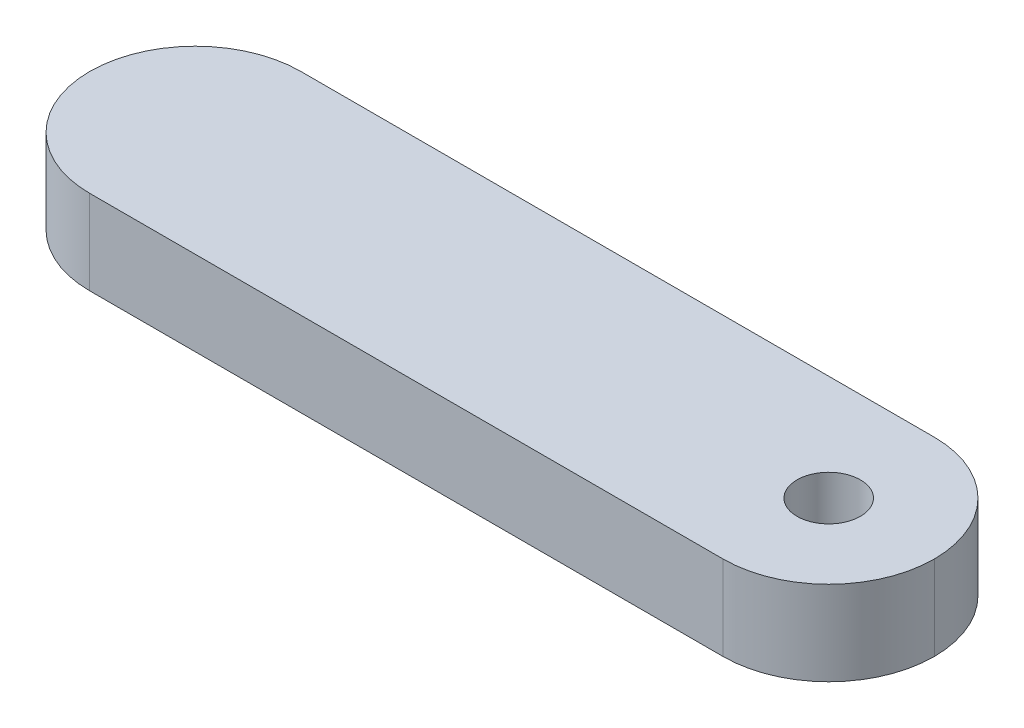
ISO-10303-21;
HEADER;
FILE_DESCRIPTION(('STEP AP214'),'2;1');
FILE_NAME('part.step','',(''),(''),'','','');
FILE_SCHEMA(('AUTOMOTIVE_DESIGN { 1 0 10303 214 1 1 1 1 }'));
ENDSEC;
DATA;
#1=APPLICATION_CONTEXT('core data for automotive mechanical design processes');
#2=APPLICATION_PROTOCOL_DEFINITION('international standard','automotive_design',2000,#1);
#3=PRODUCT_CONTEXT('',#1,'mechanical');
#4=PRODUCT('Part','Part','',(#3));
#5=PRODUCT_RELATED_PRODUCT_CATEGORY('part','',(#4));
#6=PRODUCT_DEFINITION_FORMATION('','',#4);
#7=PRODUCT_DEFINITION_CONTEXT('part definition',#1,'design');
#8=PRODUCT_DEFINITION('design','',#6,#7);
#9=PRODUCT_DEFINITION_SHAPE('','',#8);
#10=(LENGTH_UNIT() NAMED_UNIT(*) SI_UNIT(.MILLI.,.METRE.));
#11=(NAMED_UNIT(*) PLANE_ANGLE_UNIT() SI_UNIT($,.RADIAN.));
#12=(NAMED_UNIT(*) SI_UNIT($,.STERADIAN.) SOLID_ANGLE_UNIT());
#13=UNCERTAINTY_MEASURE_WITH_UNIT(LENGTH_MEASURE(1.E-05),#10,'distance_accuracy_value','');
#14=(GEOMETRIC_REPRESENTATION_CONTEXT(3) GLOBAL_UNCERTAINTY_ASSIGNED_CONTEXT((#13)) GLOBAL_UNIT_ASSIGNED_CONTEXT((#10,
#11,#12)) REPRESENTATION_CONTEXT('',''));
#15=CARTESIAN_POINT('',(0.,0.,0.));
#16=DIRECTION('',(0.,0.,1.));
#17=DIRECTION('',(1.,0.,0.));
#18=AXIS2_PLACEMENT_3D('',#15,#16,#17);
#19=CARTESIAN_POINT('',(-200.,40.,-50.));
#20=DIRECTION('',(0.,0.,1.));
#21=DIRECTION('',(1.,0.,0.));
#22=AXIS2_PLACEMENT_3D('',#19,#20,#21);
#23=PLANE('',#22);
#24=DIRECTION('',(-1.,0.,0.));
#25=VECTOR('',#24,1.);
#26=CARTESIAN_POINT('',(-200.,0.,-50.));
#27=LINE('',#26,#25);
#28=CARTESIAN_POINT('',(150.,0.,-50.));
#29=VERTEX_POINT('',#28);
#30=CARTESIAN_POINT('',(-150.,0.,-50.));
#31=VERTEX_POINT('',#30);
#32=EDGE_CURVE('E105',#29,#31,#27,.T.);
#33=ORIENTED_EDGE('',*,*,#32,.T.);
#34=DIRECTION('',(0.,-1.,0.));
#35=VECTOR('',#34,1.);
#36=CARTESIAN_POINT('',(-150.,40.,-50.));
#37=LINE('',#36,#35);
#38=CARTESIAN_POINT('',(-150.,40.,-50.));
#39=VERTEX_POINT('',#38);
#40=EDGE_CURVE('E160',#31,#39,#37,.F.);
#41=ORIENTED_EDGE('',*,*,#40,.T.);
#42=DIRECTION('',(-1.,0.,0.));
#43=VECTOR('',#42,1.);
#44=CARTESIAN_POINT('',(-200.,40.,-50.));
#45=LINE('',#44,#43);
#46=CARTESIAN_POINT('',(150.,40.,-50.));
#47=VERTEX_POINT('',#46);
#48=EDGE_CURVE('E141',#47,#39,#45,.T.);
#49=ORIENTED_EDGE('',*,*,#48,.F.);
#50=DIRECTION('',(0.,-1.,0.));
#51=VECTOR('',#50,1.);
#52=CARTESIAN_POINT('',(150.,40.,-50.));
#53=LINE('',#52,#51);
#54=EDGE_CURVE('E157',#47,#29,#53,.T.);
#55=ORIENTED_EDGE('',*,*,#54,.T.);
#56=EDGE_LOOP('',(#33,#41,#49,#55));
#57=FACE_BOUND('',#56,.T.);
#58=ADVANCED_FACE('F45',(#57),#23,.F.);
#59=CARTESIAN_POINT('',(-200.,40.,50.));
#60=DIRECTION('',(0.,0.,-1.));
#61=DIRECTION('',(-1.,0.,0.));
#62=AXIS2_PLACEMENT_3D('',#59,#60,#61);
#63=PLANE('',#62);
#64=DIRECTION('',(1.,0.,0.));
#65=VECTOR('',#64,1.);
#66=CARTESIAN_POINT('',(-200.,40.,50.));
#67=LINE('',#66,#65);
#68=CARTESIAN_POINT('',(-150.,40.,50.));
#69=VERTEX_POINT('',#68);
#70=CARTESIAN_POINT('',(150.,40.,50.));
#71=VERTEX_POINT('',#70);
#72=EDGE_CURVE('E118',#69,#71,#67,.T.);
#73=ORIENTED_EDGE('',*,*,#72,.F.);
#74=DIRECTION('',(0.,-1.,0.));
#75=VECTOR('',#74,1.);
#76=CARTESIAN_POINT('',(-150.,40.,50.));
#77=LINE('',#76,#75);
#78=CARTESIAN_POINT('',(-150.,0.,50.));
#79=VERTEX_POINT('',#78);
#80=EDGE_CURVE('E11',#69,#79,#77,.T.);
#81=ORIENTED_EDGE('',*,*,#80,.T.);
#82=DIRECTION('',(1.,0.,0.));
#83=VECTOR('',#82,1.);
#84=CARTESIAN_POINT('',(-200.,0.,50.));
#85=LINE('',#84,#83);
#86=CARTESIAN_POINT('',(150.,0.,50.));
#87=VERTEX_POINT('',#86);
#88=EDGE_CURVE('E145',#79,#87,#85,.T.);
#89=ORIENTED_EDGE('',*,*,#88,.T.);
#90=DIRECTION('',(0.,-1.,0.));
#91=VECTOR('',#90,1.);
#92=CARTESIAN_POINT('',(150.,40.,50.));
#93=LINE('',#92,#91);
#94=EDGE_CURVE('E55',#87,#71,#93,.F.);
#95=ORIENTED_EDGE('',*,*,#94,.T.);
#96=EDGE_LOOP('',(#73,#81,#89,#95));
#97=FACE_BOUND('',#96,.T.);
#98=ADVANCED_FACE('F188',(#97),#63,.F.);
#99=CARTESIAN_POINT('',(0.,40.,0.));
#100=DIRECTION('',(0.,-1.,0.));
#101=DIRECTION('',(0.,0.,-1.));
#102=AXIS2_PLACEMENT_3D('',#99,#100,#101);
#103=PLANE('',#102);
#104=CARTESIAN_POINT('',(150.,40.,0.));
#105=DIRECTION('',(0.,1.,0.));
#106=DIRECTION('',(0.,0.,1.));
#107=AXIS2_PLACEMENT_3D('',#104,#105,#106);
#108=CIRCLE('',#107,15.);
#109=CARTESIAN_POINT('',(150.,40.,15.));
#110=VERTEX_POINT('',#109);
#111=EDGE_CURVE('E138',#110,#110,#108,.T.);
#112=ORIENTED_EDGE('',*,*,#111,.F.);
#113=EDGE_LOOP('',(#112));
#114=FACE_BOUND('',#113,.T.);
#115=ORIENTED_EDGE('',*,*,#48,.T.);
#116=CARTESIAN_POINT('',(-150.,40.,0.));
#117=DIRECTION('',(0.,-1.,0.));
#118=DIRECTION('',(0.,0.,-1.));
#119=AXIS2_PLACEMENT_3D('',#116,#117,#118);
#120=CIRCLE('',#119,50.);
#121=CARTESIAN_POINT('',(-200.,40.,0.));
#122=VERTEX_POINT('',#121);
#123=EDGE_CURVE('E171',#39,#122,#120,.F.);
#124=ORIENTED_EDGE('',*,*,#123,.T.);
#125=CARTESIAN_POINT('',(-150.,40.,0.));
#126=DIRECTION('',(0.,-1.,0.));
#127=DIRECTION('',(0.,0.,-1.));
#128=AXIS2_PLACEMENT_3D('',#125,#126,#127);
#129=CIRCLE('',#128,50.);
#130=EDGE_CURVE('E69',#122,#69,#129,.F.);
#131=ORIENTED_EDGE('',*,*,#130,.T.);
#132=ORIENTED_EDGE('',*,*,#72,.T.);
#133=CARTESIAN_POINT('',(150.,40.,0.));
#134=DIRECTION('',(0.,-1.,0.));
#135=DIRECTION('',(0.,0.,-1.));
#136=AXIS2_PLACEMENT_3D('',#133,#134,#135);
#137=CIRCLE('',#136,50.);
#138=CARTESIAN_POINT('',(200.,40.,0.));
#139=VERTEX_POINT('',#138);
#140=EDGE_CURVE('E164',#71,#139,#137,.F.);
#141=ORIENTED_EDGE('',*,*,#140,.T.);
#142=CARTESIAN_POINT('',(150.,40.,0.));
#143=DIRECTION('',(0.,-1.,0.));
#144=DIRECTION('',(0.,0.,-1.));
#145=AXIS2_PLACEMENT_3D('',#142,#143,#144);
#146=CIRCLE('',#145,50.);
#147=EDGE_CURVE('E121',#139,#47,#146,.F.);
#148=ORIENTED_EDGE('',*,*,#147,.T.);
#149=EDGE_LOOP('',(#115,#124,#131,#132,#141,#148));
#150=FACE_BOUND('',#149,.T.);
#151=ADVANCED_FACE('F175',(#114,#150),#103,.F.);
#152=CARTESIAN_POINT('',(0.,0.,0.));
#153=DIRECTION('',(0.,-1.,0.));
#154=DIRECTION('',(0.,0.,-1.));
#155=AXIS2_PLACEMENT_3D('',#152,#153,#154);
#156=PLANE('',#155);
#157=CARTESIAN_POINT('',(-150.,0.,0.));
#158=DIRECTION('',(0.,-1.,0.));
#159=DIRECTION('',(0.,0.,-1.));
#160=AXIS2_PLACEMENT_3D('',#157,#158,#159);
#161=CIRCLE('',#160,15.);
#162=CARTESIAN_POINT('',(-150.,0.,-15.));
#163=VERTEX_POINT('',#162);
#164=EDGE_CURVE('E129',#163,#163,#161,.T.);
#165=ORIENTED_EDGE('',*,*,#164,.F.);
#166=EDGE_LOOP('',(#165));
#167=FACE_BOUND('',#166,.T.);
#168=CARTESIAN_POINT('',(-150.,0.,0.));
#169=DIRECTION('',(0.,-1.,0.));
#170=DIRECTION('',(0.,0.,-1.));
#171=AXIS2_PLACEMENT_3D('',#168,#169,#170);
#172=CIRCLE('',#171,50.);
#173=CARTESIAN_POINT('',(-200.,0.,0.));
#174=VERTEX_POINT('',#173);
#175=EDGE_CURVE('E111',#79,#174,#172,.T.);
#176=ORIENTED_EDGE('',*,*,#175,.T.);
#177=CARTESIAN_POINT('',(-150.,0.,0.));
#178=DIRECTION('',(0.,-1.,0.));
#179=DIRECTION('',(0.,0.,-1.));
#180=AXIS2_PLACEMENT_3D('',#177,#178,#179);
#181=CIRCLE('',#180,50.);
#182=EDGE_CURVE('E154',#174,#31,#181,.T.);
#183=ORIENTED_EDGE('',*,*,#182,.T.);
#184=ORIENTED_EDGE('',*,*,#32,.F.);
#185=CARTESIAN_POINT('',(150.,0.,0.));
#186=DIRECTION('',(0.,-1.,0.));
#187=DIRECTION('',(0.,0.,-1.));
#188=AXIS2_PLACEMENT_3D('',#185,#186,#187);
#189=CIRCLE('',#188,50.);
#190=CARTESIAN_POINT('',(200.,0.,0.));
#191=VERTEX_POINT('',#190);
#192=EDGE_CURVE('E99',#29,#191,#189,.T.);
#193=ORIENTED_EDGE('',*,*,#192,.T.);
#194=CARTESIAN_POINT('',(150.,0.,0.));
#195=DIRECTION('',(0.,-1.,0.));
#196=DIRECTION('',(0.,0.,-1.));
#197=AXIS2_PLACEMENT_3D('',#194,#195,#196);
#198=CIRCLE('',#197,50.);
#199=EDGE_CURVE('E103',#191,#87,#198,.T.);
#200=ORIENTED_EDGE('',*,*,#199,.T.);
#201=ORIENTED_EDGE('',*,*,#88,.F.);
#202=EDGE_LOOP('',(#176,#183,#184,#193,#200,#201));
#203=FACE_BOUND('',#202,.T.);
#204=ADVANCED_FACE('F101',(#167,#203),#156,.T.);
#205=CARTESIAN_POINT('',(-150.,40.,0.));
#206=DIRECTION('',(0.,-1.,0.));
#207=DIRECTION('',(0.,0.,-1.));
#208=AXIS2_PLACEMENT_3D('',#205,#206,#207);
#209=CYLINDRICAL_SURFACE('',#208,50.);
#210=ORIENTED_EDGE('',*,*,#80,.F.);
#211=ORIENTED_EDGE('',*,*,#130,.F.);
#212=DIRECTION('',(0.,-1.,0.));
#213=VECTOR('',#212,1.);
#214=CARTESIAN_POINT('',(-200.,40.,0.));
#215=LINE('',#214,#213);
#216=EDGE_CURVE('E123',#174,#122,#215,.F.);
#217=ORIENTED_EDGE('',*,*,#216,.F.);
#218=ORIENTED_EDGE('',*,*,#175,.F.);
#219=EDGE_LOOP('',(#210,#211,#217,#218));
#220=FACE_BOUND('',#219,.T.);
#221=ADVANCED_FACE('F182',(#220),#209,.T.);
#222=CARTESIAN_POINT('',(-150.,40.,0.));
#223=DIRECTION('',(0.,-1.,0.));
#224=DIRECTION('',(0.,0.,-1.));
#225=AXIS2_PLACEMENT_3D('',#222,#223,#224);
#226=CYLINDRICAL_SURFACE('',#225,50.);
#227=ORIENTED_EDGE('',*,*,#123,.F.);
#228=ORIENTED_EDGE('',*,*,#40,.F.);
#229=ORIENTED_EDGE('',*,*,#182,.F.);
#230=ORIENTED_EDGE('',*,*,#216,.T.);
#231=EDGE_LOOP('',(#227,#228,#229,#230));
#232=FACE_BOUND('',#231,.T.);
#233=ADVANCED_FACE('F185',(#232),#226,.T.);
#234=CARTESIAN_POINT('',(150.,40.,0.));
#235=DIRECTION('',(0.,-1.,0.));
#236=DIRECTION('',(0.,0.,-1.));
#237=AXIS2_PLACEMENT_3D('',#234,#235,#236);
#238=CYLINDRICAL_SURFACE('',#237,50.);
#239=DIRECTION('',(0.,-1.,0.));
#240=VECTOR('',#239,1.);
#241=CARTESIAN_POINT('',(200.,40.,0.));
#242=LINE('',#241,#240);
#243=EDGE_CURVE('E49',#139,#191,#242,.T.);
#244=ORIENTED_EDGE('',*,*,#243,.F.);
#245=ORIENTED_EDGE('',*,*,#140,.F.);
#246=ORIENTED_EDGE('',*,*,#94,.F.);
#247=ORIENTED_EDGE('',*,*,#199,.F.);
#248=EDGE_LOOP('',(#244,#245,#246,#247));
#249=FACE_BOUND('',#248,.T.);
#250=ADVANCED_FACE('F47',(#249),#238,.T.);
#251=CARTESIAN_POINT('',(150.,40.,0.));
#252=DIRECTION('',(0.,-1.,0.));
#253=DIRECTION('',(0.,0.,-1.));
#254=AXIS2_PLACEMENT_3D('',#251,#252,#253);
#255=CYLINDRICAL_SURFACE('',#254,50.);
#256=ORIENTED_EDGE('',*,*,#147,.F.);
#257=ORIENTED_EDGE('',*,*,#243,.T.);
#258=ORIENTED_EDGE('',*,*,#192,.F.);
#259=ORIENTED_EDGE('',*,*,#54,.F.);
#260=EDGE_LOOP('',(#256,#257,#258,#259));
#261=FACE_BOUND('',#260,.T.);
#262=ADVANCED_FACE('F120',(#261),#255,.T.);
#263=CARTESIAN_POINT('',(-150.,25.,0.));
#264=DIRECTION('',(0.,-1.,0.));
#265=DIRECTION('',(0.,0.,-1.));
#266=AXIS2_PLACEMENT_3D('',#263,#264,#265);
#267=CYLINDRICAL_SURFACE('',#266,15.);
#268=CARTESIAN_POINT('',(-150.,25.,0.));
#269=DIRECTION('',(0.,-1.,0.));
#270=DIRECTION('',(0.,0.,-1.));
#271=AXIS2_PLACEMENT_3D('',#268,#269,#270);
#272=CIRCLE('',#271,15.);
#273=CARTESIAN_POINT('',(-150.,25.,-15.));
#274=VERTEX_POINT('',#273);
#275=EDGE_CURVE('E124',#274,#274,#272,.T.);
#276=ORIENTED_EDGE('',*,*,#275,.F.);
#277=EDGE_LOOP('',(#276));
#278=FACE_BOUND('',#277,.T.);
#279=ORIENTED_EDGE('',*,*,#164,.T.);
#280=EDGE_LOOP('',(#279));
#281=FACE_BOUND('',#280,.T.);
#282=ADVANCED_FACE('F200',(#278,#281),#267,.F.);
#283=CARTESIAN_POINT('',(-150.,25.,0.));
#284=DIRECTION('',(0.,-1.,0.));
#285=DIRECTION('',(0.,0.,-1.));
#286=AXIS2_PLACEMENT_3D('',#283,#284,#285);
#287=PLANE('',#286);
#288=ORIENTED_EDGE('',*,*,#275,.T.);
#289=EDGE_LOOP('',(#288));
#290=FACE_BOUND('',#289,.T.);
#291=ADVANCED_FACE('F206',(#290),#287,.T.);
#292=CARTESIAN_POINT('',(150.,15.,0.));
#293=DIRECTION('',(0.,1.,0.));
#294=DIRECTION('',(0.,0.,1.));
#295=AXIS2_PLACEMENT_3D('',#292,#293,#294);
#296=CYLINDRICAL_SURFACE('',#295,15.);
#297=CARTESIAN_POINT('',(150.,15.,0.));
#298=DIRECTION('',(0.,1.,0.));
#299=DIRECTION('',(0.,0.,1.));
#300=AXIS2_PLACEMENT_3D('',#297,#298,#299);
#301=CIRCLE('',#300,15.);
#302=CARTESIAN_POINT('',(150.,15.,15.));
#303=VERTEX_POINT('',#302);
#304=EDGE_CURVE('E135',#303,#303,#301,.T.);
#305=ORIENTED_EDGE('',*,*,#304,.F.);
#306=EDGE_LOOP('',(#305));
#307=FACE_BOUND('',#306,.T.);
#308=ORIENTED_EDGE('',*,*,#111,.T.);
#309=EDGE_LOOP('',(#308));
#310=FACE_BOUND('',#309,.T.);
#311=ADVANCED_FACE('F258',(#307,#310),#296,.F.);
#312=CARTESIAN_POINT('',(150.,15.,0.));
#313=DIRECTION('',(0.,1.,0.));
#314=DIRECTION('',(0.,0.,1.));
#315=AXIS2_PLACEMENT_3D('',#312,#313,#314);
#316=PLANE('',#315);
#317=ORIENTED_EDGE('',*,*,#304,.T.);
#318=EDGE_LOOP('',(#317));
#319=FACE_BOUND('',#318,.T.);
#320=ADVANCED_FACE('F269',(#319),#316,.T.);
#321=CLOSED_SHELL('',(#58,#98,#151,#204,#221,#233,#250,#262,#282,#291,#311,#320));
#322=MANIFOLD_SOLID_BREP('B2',#321);
#323=ADVANCED_BREP_SHAPE_REPRESENTATION('',(#18,#322),#14);
#324=SHAPE_DEFINITION_REPRESENTATION(#9,#323);
ENDSEC;
END-ISO-10303-21;
